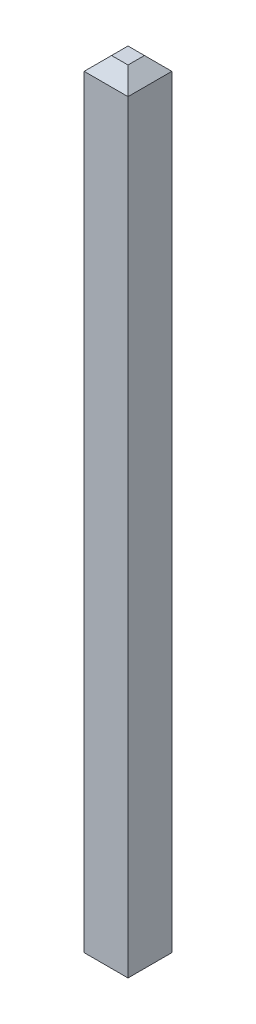
ISO-10303-21;
HEADER;
FILE_DESCRIPTION(('STEP AP214'),'2;1');
FILE_NAME('part.step','',(''),(''),'','','');
FILE_SCHEMA(('AUTOMOTIVE_DESIGN { 1 0 10303 214 1 1 1 1 }'));
ENDSEC;
DATA;
#1=APPLICATION_CONTEXT('core data for automotive mechanical design processes');
#2=APPLICATION_PROTOCOL_DEFINITION('international standard','automotive_design',2000,#1);
#3=PRODUCT_CONTEXT('',#1,'mechanical');
#4=PRODUCT('Part','Part','',(#3));
#5=PRODUCT_RELATED_PRODUCT_CATEGORY('part','',(#4));
#6=PRODUCT_DEFINITION_FORMATION('','',#4);
#7=PRODUCT_DEFINITION_CONTEXT('part definition',#1,'design');
#8=PRODUCT_DEFINITION('design','',#6,#7);
#9=PRODUCT_DEFINITION_SHAPE('','',#8);
#10=(LENGTH_UNIT() NAMED_UNIT(*) SI_UNIT(.MILLI.,.METRE.));
#11=(NAMED_UNIT(*) PLANE_ANGLE_UNIT() SI_UNIT($,.RADIAN.));
#12=(NAMED_UNIT(*) SI_UNIT($,.STERADIAN.) SOLID_ANGLE_UNIT());
#13=UNCERTAINTY_MEASURE_WITH_UNIT(LENGTH_MEASURE(1.E-05),#10,'distance_accuracy_value','');
#14=(GEOMETRIC_REPRESENTATION_CONTEXT(3) GLOBAL_UNCERTAINTY_ASSIGNED_CONTEXT((#13)) GLOBAL_UNIT_ASSIGNED_CONTEXT((#10,
#11,#12)) REPRESENTATION_CONTEXT('',''));
#15=CARTESIAN_POINT('',(0.,0.,0.));
#16=DIRECTION('',(0.,0.,1.));
#17=DIRECTION('',(1.,0.,0.));
#18=AXIS2_PLACEMENT_3D('',#15,#16,#17);
#19=CARTESIAN_POINT('',(-8.77,-4.27,-0.32));
#20=DIRECTION('',(-0.707106781186548,0.707106781186548,0.));
#21=DIRECTION('',(-0.707106781186548,-0.707106781186548,0.));
#22=AXIS2_PLACEMENT_3D('',#19,#20,#21);
#23=PLANE('',#22);
#24=DIRECTION('',(0.,0.,1.));
#25=VECTOR('',#24,1.);
#26=CARTESIAN_POINT('',(-8.56999999999999,-4.07,-0.32));
#27=LINE('',#26,#25);
#28=CARTESIAN_POINT('',(-8.57,-4.07,-0.32));
#29=VERTEX_POINT('',#28);
#30=CARTESIAN_POINT('',(-8.57,-4.07,0.32));
#31=VERTEX_POINT('',#30);
#32=EDGE_CURVE('E119',#29,#31,#27,.T.);
#33=ORIENTED_EDGE('',*,*,#32,.T.);
#34=DIRECTION('',(-0.577350269189624,-0.577350269189627,-0.577350269189626));
#35=VECTOR('',#34,1.);
#36=CARTESIAN_POINT('',(-8.57,-4.07,0.32));
#37=LINE('',#36,#35);
#38=CARTESIAN_POINT('',(-8.77,-4.27,0.12));
#39=VERTEX_POINT('',#38);
#40=EDGE_CURVE('E95',#31,#39,#37,.T.);
#41=ORIENTED_EDGE('',*,*,#40,.T.);
#42=DIRECTION('',(0.,0.,1.));
#43=VECTOR('',#42,1.);
#44=CARTESIAN_POINT('',(-8.77,-4.27,-0.32));
#45=LINE('',#44,#43);
#46=CARTESIAN_POINT('',(-8.77,-4.27,-0.12));
#47=VERTEX_POINT('',#46);
#48=EDGE_CURVE('E20',#39,#47,#45,.F.);
#49=ORIENTED_EDGE('',*,*,#48,.T.);
#50=DIRECTION('',(-0.577350269189624,-0.577350269189627,0.577350269189626));
#51=VECTOR('',#50,1.);
#52=CARTESIAN_POINT('',(-8.57,-4.07,-0.32));
#53=LINE('',#52,#51);
#54=EDGE_CURVE('E84',#29,#47,#53,.T.);
#55=ORIENTED_EDGE('',*,*,#54,.F.);
#56=EDGE_LOOP('',(#33,#41,#49,#55));
#57=FACE_BOUND('',#56,.T.);
#58=ADVANCED_FACE('F17',(#57),#23,.F.);
#59=CARTESIAN_POINT('',(-8.57,7.07,-0.32));
#60=DIRECTION('',(-0.707106781186548,-0.707106781186548,0.));
#61=DIRECTION('',(0.707106781186548,-0.707106781186548,0.));
#62=AXIS2_PLACEMENT_3D('',#59,#60,#61);
#63=PLANE('',#62);
#64=DIRECTION('',(0.,0.,1.));
#65=VECTOR('',#64,1.);
#66=CARTESIAN_POINT('',(-8.57,7.07,-0.32));
#67=LINE('',#66,#65);
#68=CARTESIAN_POINT('',(-8.57,7.07,0.32));
#69=VERTEX_POINT('',#68);
#70=CARTESIAN_POINT('',(-8.57,7.07,-0.319999999999999));
#71=VERTEX_POINT('',#70);
#72=EDGE_CURVE('E121',#69,#71,#67,.F.);
#73=ORIENTED_EDGE('',*,*,#72,.T.);
#74=DIRECTION('',(0.577350269189625,-0.577350269189628,-0.577350269189624));
#75=VECTOR('',#74,1.);
#76=CARTESIAN_POINT('',(-8.77,7.27,-0.12));
#77=LINE('',#76,#75);
#78=CARTESIAN_POINT('',(-8.77,7.27,-0.12));
#79=VERTEX_POINT('',#78);
#80=EDGE_CURVE('E78',#79,#71,#77,.T.);
#81=ORIENTED_EDGE('',*,*,#80,.F.);
#82=DIRECTION('',(0.,0.,1.));
#83=VECTOR('',#82,1.);
#84=CARTESIAN_POINT('',(-8.77,7.27,-0.32));
#85=LINE('',#84,#83);
#86=CARTESIAN_POINT('',(-8.77,7.27,0.12));
#87=VERTEX_POINT('',#86);
#88=EDGE_CURVE('E108',#79,#87,#85,.T.);
#89=ORIENTED_EDGE('',*,*,#88,.T.);
#90=DIRECTION('',(0.577350269189625,-0.577350269189628,0.577350269189625));
#91=VECTOR('',#90,1.);
#92=CARTESIAN_POINT('',(-8.77,7.27,0.119999999999999));
#93=LINE('',#92,#91);
#94=EDGE_CURVE('E116',#87,#69,#93,.T.);
#95=ORIENTED_EDGE('',*,*,#94,.T.);
#96=EDGE_LOOP('',(#73,#81,#89,#95));
#97=FACE_BOUND('',#96,.T.);
#98=ADVANCED_FACE('F214',(#97),#63,.F.);
#99=CARTESIAN_POINT('',(-8.57,-4.27,-0.32));
#100=DIRECTION('',(0.,1.,0.));
#101=DIRECTION('',(0.,0.,1.));
#102=AXIS2_PLACEMENT_3D('',#99,#100,#101);
#103=PLANE('',#102);
#104=DIRECTION('',(1.,0.,0.));
#105=VECTOR('',#104,1.);
#106=CARTESIAN_POINT('',(-8.57,-4.27,0.12));
#107=LINE('',#106,#105);
#108=CARTESIAN_POINT('',(-9.01,-4.27,0.12));
#109=VERTEX_POINT('',#108);
#110=EDGE_CURVE('E110',#39,#109,#107,.F.);
#111=ORIENTED_EDGE('',*,*,#110,.T.);
#112=DIRECTION('',(0.,0.,1.));
#113=VECTOR('',#112,1.);
#114=CARTESIAN_POINT('',(-9.01,-4.27,-0.32));
#115=LINE('',#114,#113);
#116=CARTESIAN_POINT('',(-9.01,-4.27,-0.12));
#117=VERTEX_POINT('',#116);
#118=EDGE_CURVE('E101',#109,#117,#115,.F.);
#119=ORIENTED_EDGE('',*,*,#118,.T.);
#120=DIRECTION('',(1.,0.,0.));
#121=VECTOR('',#120,1.);
#122=CARTESIAN_POINT('',(-8.89,-4.27,-0.12));
#123=LINE('',#122,#121);
#124=EDGE_CURVE('E89',#47,#117,#123,.F.);
#125=ORIENTED_EDGE('',*,*,#124,.F.);
#126=ORIENTED_EDGE('',*,*,#48,.F.);
#127=EDGE_LOOP('',(#111,#119,#125,#126));
#128=FACE_BOUND('',#127,.T.);
#129=ADVANCED_FACE('F99',(#128),#103,.F.);
#130=CARTESIAN_POINT('',(-8.89,-4.07,-0.32));
#131=DIRECTION('',(0.,-0.707106781186548,-0.707106781186548));
#132=DIRECTION('',(0.,0.707106781186548,-0.707106781186548));
#133=AXIS2_PLACEMENT_3D('',#130,#131,#132);
#134=PLANE('',#133);
#135=ORIENTED_EDGE('',*,*,#54,.T.);
#136=ORIENTED_EDGE('',*,*,#124,.T.);
#137=DIRECTION('',(-0.577350269189624,0.577350269189626,-0.577350269189628));
#138=VECTOR('',#137,1.);
#139=CARTESIAN_POINT('',(-9.01,-4.27,-0.12));
#140=LINE('',#139,#138);
#141=CARTESIAN_POINT('',(-9.21,-4.07,-0.32));
#142=VERTEX_POINT('',#141);
#143=EDGE_CURVE('E127',#117,#142,#140,.T.);
#144=ORIENTED_EDGE('',*,*,#143,.T.);
#145=DIRECTION('',(-1.,0.,0.));
#146=VECTOR('',#145,1.);
#147=CARTESIAN_POINT('',(-8.89,-4.07,-0.320000000000001));
#148=LINE('',#147,#146);
#149=EDGE_CURVE('E91',#29,#142,#148,.T.);
#150=ORIENTED_EDGE('',*,*,#149,.F.);
#151=EDGE_LOOP('',(#135,#136,#144,#150));
#152=FACE_BOUND('',#151,.T.);
#153=ADVANCED_FACE('F86',(#152),#134,.T.);
#154=CARTESIAN_POINT('',(-8.89,7.07,-0.32));
#155=DIRECTION('',(0.,0.707106781186548,-0.707106781186548));
#156=DIRECTION('',(0.,0.707106781186548,0.707106781186548));
#157=AXIS2_PLACEMENT_3D('',#154,#155,#156);
#158=PLANE('',#157);
#159=ORIENTED_EDGE('',*,*,#80,.T.);
#160=DIRECTION('',(-1.,0.,0.));
#161=VECTOR('',#160,1.);
#162=CARTESIAN_POINT('',(-8.89,7.07,-0.319999999999999));
#163=LINE('',#162,#161);
#164=CARTESIAN_POINT('',(-9.21,7.07,-0.32));
#165=VERTEX_POINT('',#164);
#166=EDGE_CURVE('E129',#165,#71,#163,.F.);
#167=ORIENTED_EDGE('',*,*,#166,.F.);
#168=DIRECTION('',(0.577350269189626,0.577350269189626,0.577350269189625));
#169=VECTOR('',#168,1.);
#170=CARTESIAN_POINT('',(-9.21,7.07,-0.32));
#171=LINE('',#170,#169);
#172=CARTESIAN_POINT('',(-9.01,7.27,-0.120000000000001));
#173=VERTEX_POINT('',#172);
#174=EDGE_CURVE('E136',#165,#173,#171,.T.);
#175=ORIENTED_EDGE('',*,*,#174,.T.);
#176=DIRECTION('',(1.,0.,0.));
#177=VECTOR('',#176,1.);
#178=CARTESIAN_POINT('',(-9.21,7.27,-0.12));
#179=LINE('',#178,#177);
#180=EDGE_CURVE('E103',#173,#79,#179,.T.);
#181=ORIENTED_EDGE('',*,*,#180,.T.);
#182=EDGE_LOOP('',(#159,#167,#175,#181));
#183=FACE_BOUND('',#182,.T.);
#184=ADVANCED_FACE('F206',(#183),#158,.T.);
#185=CARTESIAN_POINT('',(-9.21,7.27,-0.32));
#186=DIRECTION('',(0.,-1.,0.));
#187=DIRECTION('',(1.,0.,0.));
#188=AXIS2_PLACEMENT_3D('',#185,#186,#187);
#189=PLANE('',#188);
#190=ORIENTED_EDGE('',*,*,#180,.F.);
#191=DIRECTION('',(0.,0.,1.));
#192=VECTOR('',#191,1.);
#193=CARTESIAN_POINT('',(-9.01,7.27,-0.32));
#194=LINE('',#193,#192);
#195=CARTESIAN_POINT('',(-9.01,7.27,0.12));
#196=VERTEX_POINT('',#195);
#197=EDGE_CURVE('E139',#173,#196,#194,.T.);
#198=ORIENTED_EDGE('',*,*,#197,.T.);
#199=DIRECTION('',(1.,0.,0.));
#200=VECTOR('',#199,1.);
#201=CARTESIAN_POINT('',(-9.21,7.27,0.12));
#202=LINE('',#201,#200);
#203=EDGE_CURVE('E113',#196,#87,#202,.T.);
#204=ORIENTED_EDGE('',*,*,#203,.T.);
#205=ORIENTED_EDGE('',*,*,#88,.F.);
#206=EDGE_LOOP('',(#190,#198,#204,#205));
#207=FACE_BOUND('',#206,.T.);
#208=ADVANCED_FACE('F203',(#207),#189,.F.);
#209=CARTESIAN_POINT('',(-8.57,-4.27,0.12));
#210=DIRECTION('',(0.,0.707106781186548,-0.707106781186548));
#211=DIRECTION('',(0.,0.707106781186548,0.707106781186548));
#212=AXIS2_PLACEMENT_3D('',#209,#210,#211);
#213=PLANE('',#212);
#214=DIRECTION('',(-1.,0.,0.));
#215=VECTOR('',#214,1.);
#216=CARTESIAN_POINT('',(-8.89,-4.07,0.319999999999999));
#217=LINE('',#216,#215);
#218=CARTESIAN_POINT('',(-9.21,-4.07,0.32));
#219=VERTEX_POINT('',#218);
#220=EDGE_CURVE('E144',#31,#219,#217,.T.);
#221=ORIENTED_EDGE('',*,*,#220,.T.);
#222=DIRECTION('',(0.577350269189624,-0.577350269189626,-0.577350269189627));
#223=VECTOR('',#222,1.);
#224=CARTESIAN_POINT('',(-9.21,-4.07,0.32));
#225=LINE('',#224,#223);
#226=EDGE_CURVE('E123',#219,#109,#225,.T.);
#227=ORIENTED_EDGE('',*,*,#226,.T.);
#228=ORIENTED_EDGE('',*,*,#110,.F.);
#229=ORIENTED_EDGE('',*,*,#40,.F.);
#230=EDGE_LOOP('',(#221,#227,#228,#229));
#231=FACE_BOUND('',#230,.T.);
#232=ADVANCED_FACE('F176',(#231),#213,.F.);
#233=CARTESIAN_POINT('',(-9.21,7.27,0.12));
#234=DIRECTION('',(0.,-0.707106781186548,-0.707106781186548));
#235=DIRECTION('',(0.,0.707106781186548,-0.707106781186548));
#236=AXIS2_PLACEMENT_3D('',#233,#234,#235);
#237=PLANE('',#236);
#238=ORIENTED_EDGE('',*,*,#203,.F.);
#239=DIRECTION('',(-0.577350269189626,-0.577350269189626,0.577350269189625));
#240=VECTOR('',#239,1.);
#241=CARTESIAN_POINT('',(-9.01,7.27,0.12));
#242=LINE('',#241,#240);
#243=CARTESIAN_POINT('',(-9.21,7.07,0.32));
#244=VERTEX_POINT('',#243);
#245=EDGE_CURVE('E142',#196,#244,#242,.T.);
#246=ORIENTED_EDGE('',*,*,#245,.T.);
#247=DIRECTION('',(-1.,0.,0.));
#248=VECTOR('',#247,1.);
#249=CARTESIAN_POINT('',(-8.89,7.07,0.320000000000001));
#250=LINE('',#249,#248);
#251=EDGE_CURVE('E34',#244,#69,#250,.F.);
#252=ORIENTED_EDGE('',*,*,#251,.T.);
#253=ORIENTED_EDGE('',*,*,#94,.F.);
#254=EDGE_LOOP('',(#238,#246,#252,#253));
#255=FACE_BOUND('',#254,.T.);
#256=ADVANCED_FACE('F196',(#255),#237,.F.);
#257=CARTESIAN_POINT('',(-8.57,7.27,-0.32));
#258=DIRECTION('',(-1.,0.,0.));
#259=DIRECTION('',(0.,-1.,0.));
#260=AXIS2_PLACEMENT_3D('',#257,#258,#259);
#261=PLANE('',#260);
#262=ORIENTED_EDGE('',*,*,#72,.F.);
#263=DIRECTION('',(0.,1.,0.));
#264=VECTOR('',#263,1.);
#265=CARTESIAN_POINT('',(-8.57,1.5,0.32));
#266=LINE('',#265,#264);
#267=EDGE_CURVE('E148',#69,#31,#266,.F.);
#268=ORIENTED_EDGE('',*,*,#267,.T.);
#269=ORIENTED_EDGE('',*,*,#32,.F.);
#270=DIRECTION('',(0.,1.,0.));
#271=VECTOR('',#270,1.);
#272=CARTESIAN_POINT('',(-8.57,1.5,-0.32));
#273=LINE('',#272,#271);
#274=EDGE_CURVE('E132',#71,#29,#273,.F.);
#275=ORIENTED_EDGE('',*,*,#274,.F.);
#276=EDGE_LOOP('',(#262,#268,#269,#275));
#277=FACE_BOUND('',#276,.T.);
#278=ADVANCED_FACE('F193',(#277),#261,.F.);
#279=CARTESIAN_POINT('',(-9.21,-4.07,-0.32));
#280=DIRECTION('',(0.707106781186548,0.707106781186548,0.));
#281=DIRECTION('',(-0.707106781186548,0.707106781186548,0.));
#282=AXIS2_PLACEMENT_3D('',#279,#280,#281);
#283=PLANE('',#282);
#284=ORIENTED_EDGE('',*,*,#118,.F.);
#285=ORIENTED_EDGE('',*,*,#226,.F.);
#286=DIRECTION('',(0.,0.,-1.));
#287=VECTOR('',#286,1.);
#288=CARTESIAN_POINT('',(-9.21,-4.07,-0.32));
#289=LINE('',#288,#287);
#290=EDGE_CURVE('E151',#219,#142,#289,.T.);
#291=ORIENTED_EDGE('',*,*,#290,.T.);
#292=ORIENTED_EDGE('',*,*,#143,.F.);
#293=EDGE_LOOP('',(#284,#285,#291,#292));
#294=FACE_BOUND('',#293,.T.);
#295=ADVANCED_FACE('F173',(#294),#283,.F.);
#296=CARTESIAN_POINT('',(-8.89,1.5,-0.32));
#297=DIRECTION('',(0.,0.,-1.));
#298=DIRECTION('',(-1.,0.,0.));
#299=AXIS2_PLACEMENT_3D('',#296,#297,#298);
#300=PLANE('',#299);
#301=ORIENTED_EDGE('',*,*,#274,.T.);
#302=ORIENTED_EDGE('',*,*,#149,.T.);
#303=DIRECTION('',(0.,1.,0.));
#304=VECTOR('',#303,1.);
#305=CARTESIAN_POINT('',(-9.21,-4.27,-0.32));
#306=LINE('',#305,#304);
#307=EDGE_CURVE('E154',#142,#165,#306,.T.);
#308=ORIENTED_EDGE('',*,*,#307,.T.);
#309=ORIENTED_EDGE('',*,*,#166,.T.);
#310=EDGE_LOOP('',(#301,#302,#308,#309));
#311=FACE_BOUND('',#310,.T.);
#312=ADVANCED_FACE('F170',(#311),#300,.T.);
#313=CARTESIAN_POINT('',(-9.01,7.27,-0.32));
#314=DIRECTION('',(0.707106781186548,-0.707106781186548,0.));
#315=DIRECTION('',(0.707106781186548,0.707106781186548,0.));
#316=AXIS2_PLACEMENT_3D('',#313,#314,#315);
#317=PLANE('',#316);
#318=ORIENTED_EDGE('',*,*,#197,.F.);
#319=ORIENTED_EDGE('',*,*,#174,.F.);
#320=DIRECTION('',(0.,0.,-1.));
#321=VECTOR('',#320,1.);
#322=CARTESIAN_POINT('',(-9.21,7.07,-0.32));
#323=LINE('',#322,#321);
#324=EDGE_CURVE('E26',#165,#244,#323,.F.);
#325=ORIENTED_EDGE('',*,*,#324,.T.);
#326=ORIENTED_EDGE('',*,*,#245,.F.);
#327=EDGE_LOOP('',(#318,#319,#325,#326));
#328=FACE_BOUND('',#327,.T.);
#329=ADVANCED_FACE('F162',(#328),#317,.F.);
#330=CARTESIAN_POINT('',(-8.89,1.5,0.32));
#331=DIRECTION('',(0.,0.,-1.));
#332=DIRECTION('',(-1.,0.,0.));
#333=AXIS2_PLACEMENT_3D('',#330,#331,#332);
#334=PLANE('',#333);
#335=ORIENTED_EDGE('',*,*,#251,.F.);
#336=DIRECTION('',(0.,1.,0.));
#337=VECTOR('',#336,1.);
#338=CARTESIAN_POINT('',(-9.21,-4.27,0.32));
#339=LINE('',#338,#337);
#340=EDGE_CURVE('E11',#244,#219,#339,.F.);
#341=ORIENTED_EDGE('',*,*,#340,.T.);
#342=ORIENTED_EDGE('',*,*,#220,.F.);
#343=ORIENTED_EDGE('',*,*,#267,.F.);
#344=EDGE_LOOP('',(#335,#341,#342,#343));
#345=FACE_BOUND('',#344,.T.);
#346=ADVANCED_FACE('F177',(#345),#334,.F.);
#347=CARTESIAN_POINT('',(-9.21,-4.27,-0.32));
#348=DIRECTION('',(1.,0.,0.));
#349=DIRECTION('',(0.,0.,-1.));
#350=AXIS2_PLACEMENT_3D('',#347,#348,#349);
#351=PLANE('',#350);
#352=ORIENTED_EDGE('',*,*,#324,.F.);
#353=ORIENTED_EDGE('',*,*,#307,.F.);
#354=ORIENTED_EDGE('',*,*,#290,.F.);
#355=ORIENTED_EDGE('',*,*,#340,.F.);
#356=EDGE_LOOP('',(#352,#353,#354,#355));
#357=FACE_BOUND('',#356,.T.);
#358=ADVANCED_FACE('F167',(#357),#351,.F.);
#359=CLOSED_SHELL('',(#58,#98,#129,#153,#184,#208,#232,#256,#278,#295,#312,#329,#346,#358));
#360=MANIFOLD_SOLID_BREP('B1',#359);
#361=ADVANCED_BREP_SHAPE_REPRESENTATION('',(#18,#360),#14);
#362=SHAPE_DEFINITION_REPRESENTATION(#9,#361);
ENDSEC;
END-ISO-10303-21;
